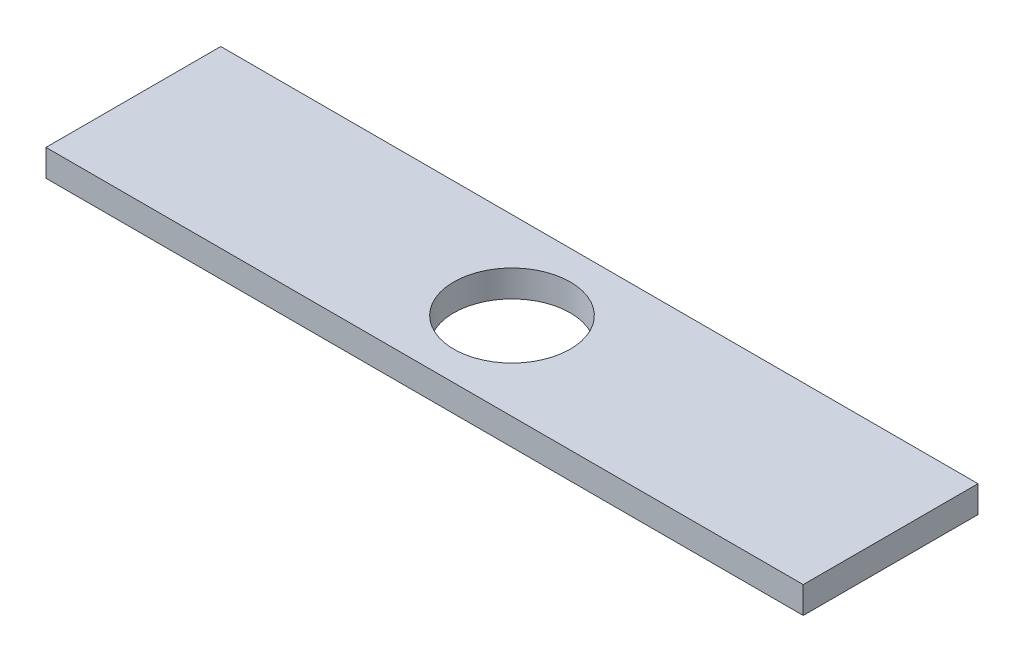
ISO-10303-21;
HEADER;
FILE_DESCRIPTION(('STEP AP214'),'2;1');
FILE_NAME('part.step','',(''),(''),'','','');
FILE_SCHEMA(('AUTOMOTIVE_DESIGN { 1 0 10303 214 1 1 1 1 }'));
ENDSEC;
DATA;
#1=APPLICATION_CONTEXT('core data for automotive mechanical design processes');
#2=APPLICATION_PROTOCOL_DEFINITION('international standard','automotive_design',2000,#1);
#3=PRODUCT_CONTEXT('',#1,'mechanical');
#4=PRODUCT('Part','Part','',(#3));
#5=PRODUCT_RELATED_PRODUCT_CATEGORY('part','',(#4));
#6=PRODUCT_DEFINITION_FORMATION('','',#4);
#7=PRODUCT_DEFINITION_CONTEXT('part definition',#1,'design');
#8=PRODUCT_DEFINITION('design','',#6,#7);
#9=PRODUCT_DEFINITION_SHAPE('','',#8);
#10=(LENGTH_UNIT() NAMED_UNIT(*) SI_UNIT(.MILLI.,.METRE.));
#11=(NAMED_UNIT(*) PLANE_ANGLE_UNIT() SI_UNIT($,.RADIAN.));
#12=(NAMED_UNIT(*) SI_UNIT($,.STERADIAN.) SOLID_ANGLE_UNIT());
#13=UNCERTAINTY_MEASURE_WITH_UNIT(LENGTH_MEASURE(1.E-05),#10,'distance_accuracy_value','');
#14=(GEOMETRIC_REPRESENTATION_CONTEXT(3) GLOBAL_UNCERTAINTY_ASSIGNED_CONTEXT((#13)) GLOBAL_UNIT_ASSIGNED_CONTEXT((#10,
#11,#12)) REPRESENTATION_CONTEXT('',''));
#15=CARTESIAN_POINT('',(0.,0.,0.));
#16=DIRECTION('',(0.,0.,1.));
#17=DIRECTION('',(1.,0.,0.));
#18=AXIS2_PLACEMENT_3D('',#15,#16,#17);
#19=CARTESIAN_POINT('',(0.,5.,0.));
#20=DIRECTION('',(0.,1.,0.));
#21=DIRECTION('',(0.,0.,1.));
#22=AXIS2_PLACEMENT_3D('',#19,#20,#21);
#23=PLANE('',#22);
#24=CARTESIAN_POINT('',(0.,5.,0.));
#25=DIRECTION('',(0.,-1.,0.));
#26=DIRECTION('',(0.,0.,-1.));
#27=AXIS2_PLACEMENT_3D('',#24,#25,#26);
#28=CIRCLE('',#27,10.);
#29=CARTESIAN_POINT('',(0.,5.,-10.));
#30=VERTEX_POINT('',#29);
#31=EDGE_CURVE('E20',#30,#30,#28,.T.);
#32=ORIENTED_EDGE('',*,*,#31,.T.);
#33=EDGE_LOOP('',(#32));
#34=FACE_BOUND('',#33,.T.);
#35=DIRECTION('',(-1.,0.,0.));
#36=VECTOR('',#35,1.);
#37=CARTESIAN_POINT('',(65.,5.,-15.));
#38=LINE('',#37,#36);
#39=CARTESIAN_POINT('',(-65.,5.,-15.));
#40=VERTEX_POINT('',#39);
#41=CARTESIAN_POINT('',(65.,5.,-15.));
#42=VERTEX_POINT('',#41);
#43=EDGE_CURVE('E70',#40,#42,#38,.F.);
#44=ORIENTED_EDGE('',*,*,#43,.F.);
#45=DIRECTION('',(0.,0.,1.));
#46=VECTOR('',#45,1.);
#47=CARTESIAN_POINT('',(-65.,5.,-15.));
#48=LINE('',#47,#46);
#49=CARTESIAN_POINT('',(-65.,5.,15.));
#50=VERTEX_POINT('',#49);
#51=EDGE_CURVE('E67',#50,#40,#48,.F.);
#52=ORIENTED_EDGE('',*,*,#51,.F.);
#53=DIRECTION('',(1.,0.,0.));
#54=VECTOR('',#53,1.);
#55=CARTESIAN_POINT('',(-65.,5.,15.));
#56=LINE('',#55,#54);
#57=CARTESIAN_POINT('',(65.,5.,15.));
#58=VERTEX_POINT('',#57);
#59=EDGE_CURVE('E58',#58,#50,#56,.F.);
#60=ORIENTED_EDGE('',*,*,#59,.F.);
#61=DIRECTION('',(0.,0.,-1.));
#62=VECTOR('',#61,1.);
#63=CARTESIAN_POINT('',(65.,5.,15.));
#64=LINE('',#63,#62);
#65=EDGE_CURVE('E53',#42,#58,#64,.F.);
#66=ORIENTED_EDGE('',*,*,#65,.F.);
#67=EDGE_LOOP('',(#44,#52,#60,#66));
#68=FACE_BOUND('',#67,.T.);
#69=ADVANCED_FACE('F17',(#34,#68),#23,.T.);
#70=CARTESIAN_POINT('',(-65.,0.,-15.));
#71=DIRECTION('',(-1.,0.,0.));
#72=DIRECTION('',(0.,0.,1.));
#73=AXIS2_PLACEMENT_3D('',#70,#71,#72);
#74=PLANE('',#73);
#75=DIRECTION('',(0.,1.,0.));
#76=VECTOR('',#75,1.);
#77=CARTESIAN_POINT('',(-65.,0.,-15.));
#78=LINE('',#77,#76);
#79=CARTESIAN_POINT('',(-65.,0.4,-15.));
#80=VERTEX_POINT('',#79);
#81=EDGE_CURVE('E82',#80,#40,#78,.T.);
#82=ORIENTED_EDGE('',*,*,#81,.F.);
#83=DIRECTION('',(0.,0.,1.));
#84=VECTOR('',#83,1.);
#85=CARTESIAN_POINT('',(-65.,0.4,-517.));
#86=LINE('',#85,#84);
#87=CARTESIAN_POINT('',(-65.,0.4,15.));
#88=VERTEX_POINT('',#87);
#89=EDGE_CURVE('E77',#80,#88,#86,.T.);
#90=ORIENTED_EDGE('',*,*,#89,.T.);
#91=DIRECTION('',(0.,1.,0.));
#92=VECTOR('',#91,1.);
#93=CARTESIAN_POINT('',(-65.,0.,15.));
#94=LINE('',#93,#92);
#95=EDGE_CURVE('E63',#50,#88,#94,.F.);
#96=ORIENTED_EDGE('',*,*,#95,.F.);
#97=ORIENTED_EDGE('',*,*,#51,.T.);
#98=EDGE_LOOP('',(#82,#90,#96,#97));
#99=FACE_BOUND('',#98,.T.);
#100=ADVANCED_FACE('F76',(#99),#74,.T.);
#101=CARTESIAN_POINT('',(-65.,0.,15.));
#102=DIRECTION('',(0.,0.,1.));
#103=DIRECTION('',(1.,0.,0.));
#104=AXIS2_PLACEMENT_3D('',#101,#102,#103);
#105=PLANE('',#104);
#106=ORIENTED_EDGE('',*,*,#95,.T.);
#107=DIRECTION('',(1.,0.,0.));
#108=VECTOR('',#107,1.);
#109=CARTESIAN_POINT('',(-142.363011818,0.4,15.));
#110=LINE('',#109,#108);
#111=CARTESIAN_POINT('',(65.,0.4,15.));
#112=VERTEX_POINT('',#111);
#113=EDGE_CURVE('E87',#88,#112,#110,.T.);
#114=ORIENTED_EDGE('',*,*,#113,.T.);
#115=DIRECTION('',(0.,1.,0.));
#116=VECTOR('',#115,1.);
#117=CARTESIAN_POINT('',(65.,0.,15.));
#118=LINE('',#117,#116);
#119=EDGE_CURVE('E65',#58,#112,#118,.F.);
#120=ORIENTED_EDGE('',*,*,#119,.F.);
#121=ORIENTED_EDGE('',*,*,#59,.T.);
#122=EDGE_LOOP('',(#106,#114,#120,#121));
#123=FACE_BOUND('',#122,.T.);
#124=ADVANCED_FACE('F60',(#123),#105,.T.);
#125=CARTESIAN_POINT('',(65.,0.,15.));
#126=DIRECTION('',(1.,0.,0.));
#127=DIRECTION('',(0.,0.,-1.));
#128=AXIS2_PLACEMENT_3D('',#125,#126,#127);
#129=PLANE('',#128);
#130=ORIENTED_EDGE('',*,*,#119,.T.);
#131=DIRECTION('',(0.,0.,1.));
#132=VECTOR('',#131,1.);
#133=CARTESIAN_POINT('',(65.,0.4,-517.));
#134=LINE('',#133,#132);
#135=CARTESIAN_POINT('',(65.,0.4,-15.));
#136=VERTEX_POINT('',#135);
#137=EDGE_CURVE('E89',#112,#136,#134,.F.);
#138=ORIENTED_EDGE('',*,*,#137,.T.);
#139=DIRECTION('',(0.,1.,0.));
#140=VECTOR('',#139,1.);
#141=CARTESIAN_POINT('',(65.,0.,-15.));
#142=LINE('',#141,#140);
#143=EDGE_CURVE('E34',#42,#136,#142,.F.);
#144=ORIENTED_EDGE('',*,*,#143,.F.);
#145=ORIENTED_EDGE('',*,*,#65,.T.);
#146=EDGE_LOOP('',(#130,#138,#144,#145));
#147=FACE_BOUND('',#146,.T.);
#148=ADVANCED_FACE('F96',(#147),#129,.T.);
#149=CARTESIAN_POINT('',(65.,0.,-15.));
#150=DIRECTION('',(0.,0.,-1.));
#151=DIRECTION('',(-1.,0.,0.));
#152=AXIS2_PLACEMENT_3D('',#149,#150,#151);
#153=PLANE('',#152);
#154=ORIENTED_EDGE('',*,*,#143,.T.);
#155=DIRECTION('',(1.,0.,0.));
#156=VECTOR('',#155,1.);
#157=CARTESIAN_POINT('',(-142.363011818,0.4,-15.));
#158=LINE('',#157,#156);
#159=EDGE_CURVE('E26',#136,#80,#158,.F.);
#160=ORIENTED_EDGE('',*,*,#159,.T.);
#161=ORIENTED_EDGE('',*,*,#81,.T.);
#162=ORIENTED_EDGE('',*,*,#43,.T.);
#163=EDGE_LOOP('',(#154,#160,#161,#162));
#164=FACE_BOUND('',#163,.T.);
#165=ADVANCED_FACE('F92',(#164),#153,.T.);
#166=CARTESIAN_POINT('',(0.,20.,0.));
#167=DIRECTION('',(0.,-1.,0.));
#168=DIRECTION('',(0.,0.,-1.));
#169=AXIS2_PLACEMENT_3D('',#166,#167,#168);
#170=CYLINDRICAL_SURFACE('',#169,10.);
#171=ORIENTED_EDGE('',*,*,#31,.F.);
#172=EDGE_LOOP('',(#171));
#173=FACE_BOUND('',#172,.T.);
#174=CARTESIAN_POINT('',(0.,0.400000000000001,0.));
#175=DIRECTION('',(0.,-1.,0.));
#176=DIRECTION('',(0.,0.,-1.));
#177=AXIS2_PLACEMENT_3D('',#174,#175,#176);
#178=CIRCLE('',#177,10.);
#179=CARTESIAN_POINT('',(0.,0.400000000000001,-10.));
#180=VERTEX_POINT('',#179);
#181=EDGE_CURVE('E11',#180,#180,#178,.T.);
#182=ORIENTED_EDGE('',*,*,#181,.T.);
#183=EDGE_LOOP('',(#182));
#184=FACE_BOUND('',#183,.T.);
#185=ADVANCED_FACE('F104',(#173,#184),#170,.F.);
#186=CARTESIAN_POINT('',(-142.363011818,0.4,-517.));
#187=DIRECTION('',(0.,1.,0.));
#188=DIRECTION('',(0.,0.,1.));
#189=AXIS2_PLACEMENT_3D('',#186,#187,#188);
#190=PLANE('',#189);
#191=ORIENTED_EDGE('',*,*,#181,.F.);
#192=EDGE_LOOP('',(#191));
#193=FACE_BOUND('',#192,.T.);
#194=ORIENTED_EDGE('',*,*,#137,.F.);
#195=ORIENTED_EDGE('',*,*,#113,.F.);
#196=ORIENTED_EDGE('',*,*,#89,.F.);
#197=ORIENTED_EDGE('',*,*,#159,.F.);
#198=EDGE_LOOP('',(#194,#195,#196,#197));
#199=FACE_BOUND('',#198,.T.);
#200=ADVANCED_FACE('F95',(#193,#199),#190,.F.);
#201=CLOSED_SHELL('',(#69,#100,#124,#148,#165,#185,#200));
#202=MANIFOLD_SOLID_BREP('B1',#201);
#203=ADVANCED_BREP_SHAPE_REPRESENTATION('',(#18,#202),#14);
#204=SHAPE_DEFINITION_REPRESENTATION(#9,#203);
ENDSEC;
END-ISO-10303-21;
